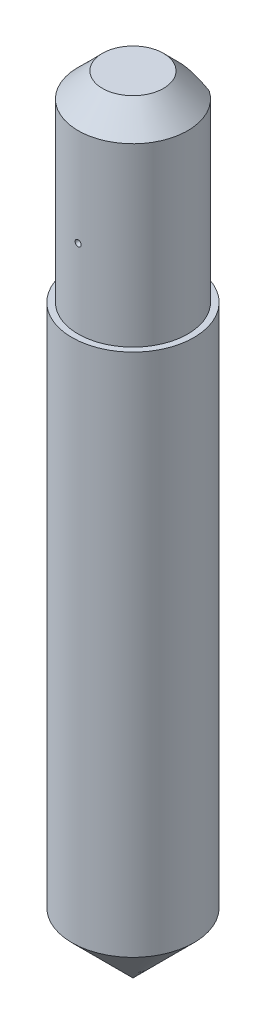
ISO-10303-21;
HEADER;
FILE_DESCRIPTION(('STEP AP214'),'2;1');
FILE_NAME('part.step','',(''),(''),'','','');
FILE_SCHEMA(('AUTOMOTIVE_DESIGN { 1 0 10303 214 1 1 1 1 }'));
ENDSEC;
DATA;
#1=APPLICATION_CONTEXT('core data for automotive mechanical design processes');
#2=APPLICATION_PROTOCOL_DEFINITION('international standard','automotive_design',2000,#1);
#3=PRODUCT_CONTEXT('',#1,'mechanical');
#4=PRODUCT('Part','Part','',(#3));
#5=PRODUCT_RELATED_PRODUCT_CATEGORY('part','',(#4));
#6=PRODUCT_DEFINITION_FORMATION('','',#4);
#7=PRODUCT_DEFINITION_CONTEXT('part definition',#1,'design');
#8=PRODUCT_DEFINITION('design','',#6,#7);
#9=PRODUCT_DEFINITION_SHAPE('','',#8);
#10=(LENGTH_UNIT() NAMED_UNIT(*) SI_UNIT(.MILLI.,.METRE.));
#11=(NAMED_UNIT(*) PLANE_ANGLE_UNIT() SI_UNIT($,.RADIAN.));
#12=(NAMED_UNIT(*) SI_UNIT($,.STERADIAN.) SOLID_ANGLE_UNIT());
#13=UNCERTAINTY_MEASURE_WITH_UNIT(LENGTH_MEASURE(1.E-05),#10,'distance_accuracy_value','');
#14=(GEOMETRIC_REPRESENTATION_CONTEXT(3) GLOBAL_UNCERTAINTY_ASSIGNED_CONTEXT((#13)) GLOBAL_UNIT_ASSIGNED_CONTEXT((#10,
#11,#12)) REPRESENTATION_CONTEXT('',''));
#15=CARTESIAN_POINT('',(0.,0.,0.));
#16=DIRECTION('',(0.,0.,1.));
#17=DIRECTION('',(1.,0.,0.));
#18=AXIS2_PLACEMENT_3D('',#15,#16,#17);
#19=CARTESIAN_POINT('',(0.,48.,0.));
#20=DIRECTION('',(0.,-1.,0.));
#21=DIRECTION('',(0.,0.,-1.));
#22=AXIS2_PLACEMENT_3D('',#19,#20,#21);
#23=CYLINDRICAL_SURFACE('',#22,5.);
#24=CARTESIAN_POINT('',(0.,5.00000000000002,0.));
#25=DIRECTION('',(0.,1.,0.));
#26=DIRECTION('',(0.,0.,1.));
#27=AXIS2_PLACEMENT_3D('',#24,#25,#26);
#28=CIRCLE('',#27,5.);
#29=CARTESIAN_POINT('',(0.,5.00000000000002,5.));
#30=VERTEX_POINT('',#29);
#31=EDGE_CURVE('E113',#30,#30,#28,.T.);
#32=ORIENTED_EDGE('',*,*,#31,.T.);
#33=EDGE_LOOP('',(#32));
#34=FACE_BOUND('',#33,.T.);
#35=CARTESIAN_POINT('',(0.,48.,0.));
#36=DIRECTION('',(0.,1.,0.));
#37=DIRECTION('',(0.,0.,1.));
#38=AXIS2_PLACEMENT_3D('',#35,#36,#37);
#39=CIRCLE('',#38,5.);
#40=CARTESIAN_POINT('',(0.,48.,5.));
#41=VERTEX_POINT('',#40);
#42=EDGE_CURVE('E109',#41,#41,#39,.T.);
#43=ORIENTED_EDGE('',*,*,#42,.F.);
#44=EDGE_LOOP('',(#43));
#45=FACE_BOUND('',#44,.T.);
#46=ADVANCED_FACE('F45',(#34,#45),#23,.T.);
#47=CARTESIAN_POINT('',(0.,48.,0.));
#48=DIRECTION('',(0.,1.,0.));
#49=DIRECTION('',(0.,0.,1.));
#50=AXIS2_PLACEMENT_3D('',#47,#48,#49);
#51=PLANE('',#50);
#52=CARTESIAN_POINT('',(0.,48.,0.));
#53=DIRECTION('',(0.,1.,0.));
#54=DIRECTION('',(0.,0.,1.));
#55=AXIS2_PLACEMENT_3D('',#52,#53,#54);
#56=CIRCLE('',#55,4.5);
#57=CARTESIAN_POINT('',(-2.56124969497314,48.,-3.7));
#58=VERTEX_POINT('',#57);
#59=CARTESIAN_POINT('',(2.56124969497314,48.,-3.7));
#60=VERTEX_POINT('',#59);
#61=EDGE_CURVE('E90',#58,#60,#56,.T.);
#62=ORIENTED_EDGE('',*,*,#61,.F.);
#63=DIRECTION('',(-1.,0.,0.));
#64=VECTOR('',#63,1.);
#65=CARTESIAN_POINT('',(-2.56124969497314,48.,-3.7));
#66=LINE('',#65,#64);
#67=EDGE_CURVE('E95',#60,#58,#66,.T.);
#68=ORIENTED_EDGE('',*,*,#67,.F.);
#69=EDGE_LOOP('',(#62,#68));
#70=FACE_BOUND('',#69,.T.);
#71=ORIENTED_EDGE('',*,*,#42,.T.);
#72=EDGE_LOOP('',(#71));
#73=FACE_BOUND('',#72,.T.);
#74=ADVANCED_FACE('F99',(#70,#73),#51,.T.);
#75=CARTESIAN_POINT('',(0.,5.00000000000002,0.));
#76=DIRECTION('',(0.,1.,0.));
#77=DIRECTION('',(0.,0.,1.));
#78=AXIS2_PLACEMENT_3D('',#75,#76,#77);
#79=CONICAL_SURFACE('',#78,5.00000000000003,0.78539816339745);
#80=CARTESIAN_POINT('',(0.,0.,0.));
#81=VERTEX_POINT('',#80);
#82=VERTEX_LOOP('',#81);
#83=FACE_BOUND('',#82,.T.);
#84=ORIENTED_EDGE('',*,*,#31,.F.);
#85=EDGE_LOOP('',(#84));
#86=FACE_BOUND('',#85,.T.);
#87=ADVANCED_FACE('F132',(#83,#86),#79,.T.);
#88=CARTESIAN_POINT('',(0.,64.45,0.));
#89=DIRECTION('',(0.,-1.,0.));
#90=DIRECTION('',(0.,0.,-1.));
#91=AXIS2_PLACEMENT_3D('',#88,#89,#90);
#92=CYLINDRICAL_SURFACE('',#91,4.5);
#93=CARTESIAN_POINT('',(-0.249903530770433,54.45,4.49305555555555));
#94=CARTESIAN_POINT('',(-0.24990291784127,54.4640399386103,4.49305564844273));
#95=CARTESIAN_POINT('',(-0.248718258594823,54.4780897708447,4.49312196620518));
#96=CARTESIAN_POINT('',(-0.244008814696952,54.5058020570536,4.4933801359805));
#97=CARTESIAN_POINT('',(-0.240481290017374,54.5194640378969,4.49357213497631));
#98=CARTESIAN_POINT('',(-0.231186141050694,54.5459955292694,4.49405991326546));
#99=CARTESIAN_POINT('',(-0.225419583673975,54.5588654138579,4.49435564312405));
#100=CARTESIAN_POINT('',(-0.211810690354123,54.5834499954709,4.49501751008353));
#101=CARTESIAN_POINT('',(-0.203968851060851,54.5951649679661,4.49538363033309));
#102=CARTESIAN_POINT('',(-0.186427727560494,54.6171149553588,4.49614518913201));
#103=CARTESIAN_POINT('',(-0.176727898073159,54.6273495342413,4.49654063626725));
#104=CARTESIAN_POINT('',(-0.155746230395671,54.6460446482927,4.49731620905089));
#105=CARTESIAN_POINT('',(-0.144464332890897,54.6545051169174,4.49769633412414));
#106=CARTESIAN_POINT('',(-0.12064001918251,54.6694104773633,4.4983983564943));
#107=CARTESIAN_POINT('',(-0.108097775969411,54.6758556452996,4.49872026176531));
#108=CARTESIAN_POINT('',(-0.0821073634325151,54.6865489009583,4.49926962514753));
#109=CARTESIAN_POINT('',(-0.0686591997162049,54.6907970022787,4.49949708384328));
#110=CARTESIAN_POINT('',(-0.041249269639048,54.6969731055139,4.49983178716786));
#111=CARTESIAN_POINT('',(-0.0272878897361652,54.6989028177592,4.49993912041209));
#112=CARTESIAN_POINT('',(0.000761081279061244,54.7003930133089,4.50002178663825));
#113=CARTESIAN_POINT('',(0.01484867165789,54.6999535103738,4.49999712038684));
#114=CARTESIAN_POINT('',(0.0427414433177844,54.6967187606186,4.49981862098568));
#115=CARTESIAN_POINT('',(0.0565467859943266,54.6939249009858,4.49966486389647));
#116=CARTESIAN_POINT('',(0.0834919998670323,54.686062548152,4.4992455778447));
#117=CARTESIAN_POINT('',(0.096631869610343,54.6809940499853,4.49898004863814));
#118=CARTESIAN_POINT('',(0.121877535065867,54.6687243083824,4.49836698480398));
#119=CARTESIAN_POINT('',(0.133983031025344,54.661522449399,4.49801942651408));
#120=CARTESIAN_POINT('',(0.156813253968043,54.645190519042,4.49728143119693));
#121=CARTESIAN_POINT('',(0.167537975176558,54.6360604396045,4.49689099399036));
#122=CARTESIAN_POINT('',(0.187311676963675,54.6161223963917,4.49611082547028));
#123=CARTESIAN_POINT('',(0.19635930401668,54.6053130901893,4.49572109497614));
#124=CARTESIAN_POINT('',(0.21251249369392,54.5823281882609,4.49498654420547));
#125=CARTESIAN_POINT('',(0.219618051490093,54.5701525891383,4.49464172404057));
#126=CARTESIAN_POINT('',(0.231688772923491,54.5447751892896,4.49403571762956));
#127=CARTESIAN_POINT('',(0.236653099236861,54.5315729894912,4.49377456411135));
#128=CARTESIAN_POINT('',(0.244296974217683,54.5045212778801,4.49336552754886));
#129=CARTESIAN_POINT('',(0.246976525896264,54.4906717669205,4.4932176443553));
#130=CARTESIAN_POINT('',(0.249974789874456,54.462721705743,4.49305184802764));
#131=CARTESIAN_POINT('',(0.25029400037601,54.448621209131,4.49303390746631));
#132=CARTESIAN_POINT('',(0.248563874365259,54.4205667493636,4.49312994709994));
#133=CARTESIAN_POINT('',(0.24651453970705,54.4066127860934,4.49324392719163));
#134=CARTESIAN_POINT('',(0.240105733074007,54.3792496255379,4.49359092775875));
#135=CARTESIAN_POINT('',(0.235746607227576,54.3658403469541,4.49382393039815));
#136=CARTESIAN_POINT('',(0.224841561447194,54.3399446807631,4.49438270603006));
#137=CARTESIAN_POINT('',(0.218295637700879,54.3274582947648,4.49470847918431));
#138=CARTESIAN_POINT('',(0.20320001551845,54.3037594662351,4.49541618147608));
#139=CARTESIAN_POINT('',(0.194649826327386,54.2925473367121,4.49579812435851));
#140=CARTESIAN_POINT('',(0.1757882103376,54.2717184040547,4.49657506969631));
#141=CARTESIAN_POINT('',(0.165476780939624,54.2621016032747,4.49697007217096));
#142=CARTESIAN_POINT('',(0.143383551784463,54.244735337121,4.49772866068459));
#143=CARTESIAN_POINT('',(0.131601635182849,54.2369860202806,4.49809224422313));
#144=CARTESIAN_POINT('',(0.106902051226345,54.2235757007095,4.4987469780615));
#145=CARTESIAN_POINT('',(0.0939843887538766,54.217914689002,4.49903812867269));
#146=CARTESIAN_POINT('',(0.0673879522613935,54.2088444904046,4.49951503101844));
#147=CARTESIAN_POINT('',(0.0537096305326379,54.205433980556,4.49970084466633));
#148=CARTESIAN_POINT('',(0.0259735489646082,54.20095638979,4.49994640347143));
#149=CARTESIAN_POINT('',(0.0119157902907211,54.1998893016758,4.50000614901581));
#150=CARTESIAN_POINT('',(-0.0161688322552493,54.2001287869094,4.49999284608048));
#151=CARTESIAN_POINT('',(-0.0301957113959328,54.2014335794041,4.49991989723022));
#152=CARTESIAN_POINT('',(-0.0578309534682183,54.2063762937505,4.4996496094896));
#153=CARTESIAN_POINT('',(-0.0714393158863756,54.2100142184645,4.49945227044663));
#154=CARTESIAN_POINT('',(-0.0978516439224202,54.2195200172041,4.49895539818731));
#155=CARTESIAN_POINT('',(-0.110655601577224,54.2253879133009,4.49865586395948));
#156=CARTESIAN_POINT('',(-0.135096009725653,54.2391871403693,4.49798829626126));
#157=CARTESIAN_POINT('',(-0.146732499745934,54.2471184014495,4.49762026511116));
#158=CARTESIAN_POINT('',(-0.168516601799044,54.2648255440166,4.49685681831727));
#159=CARTESIAN_POINT('',(-0.178663256432336,54.2746026025087,4.4964613853026));
#160=CARTESIAN_POINT('',(-0.197174411056968,54.2957242084145,4.49568774868332));
#161=CARTESIAN_POINT('',(-0.205538474272178,54.3070691388732,4.49530954931916));
#162=CARTESIAN_POINT('',(-0.220252742993022,54.3310143125615,4.49461268837282));
#163=CARTESIAN_POINT('',(-0.22660080021459,54.343615876219,4.4942940904503));
#164=CARTESIAN_POINT('',(-0.237085843482598,54.3696976733571,4.49375323349271));
#165=CARTESIAN_POINT('',(-0.241225409692588,54.3831768607579,4.49353086209458));
#166=CARTESIAN_POINT('',(-0.246098451302465,54.4056155164446,4.49326594941829));
#167=CARTESIAN_POINT('',(-0.247523546605391,54.4144304284589,4.4931874005674));
#168=CARTESIAN_POINT('',(-0.249426281016253,54.4321622288892,4.49308217412876));
#169=CARTESIAN_POINT('',(-0.249903920221507,54.4410791172948,4.49305549653566));
#170=CARTESIAN_POINT('',(-0.249903530770433,54.45,4.49305555555555));
#171=B_SPLINE_CURVE_WITH_KNOTS('',3,(#93,#94,#95,#96,#97,#98,#99,#100,#101,#102,#103,#104,#105,
#106,#107,#108,#109,#110,#111,#112,#113,#114,#115,#116,#117,#118,#119,#120,#121,#122,#123,#124,
#125,#126,#127,#128,#129,#130,#131,#132,#133,#134,#135,#136,#137,#138,#139,#140,#141,#142,#143,
#144,#145,#146,#147,#148,#149,#150,#151,#152,#153,#154,#155,#156,#157,#158,#159,#160,#161,#162,
#163,#164,#165,#166,#167,#168,#169,#170),.UNSPECIFIED.,.T.,.F.,(4,2,2,2,2,2,2,2,2,2,2,2,2,2,2,2,
2,2,2,2,2,2,2,2,2,2,2,2,2,2,2,2,2,2,2,2,2,2,4),(0.,0.0420872809245657,0.0842238706474989,
0.126340406664677,0.168446872586925,0.210565714839087,0.25268613662602,0.294800784991731,
0.336915172699174,0.378998472508264,0.421081527894497,0.463139805258639,0.505198174439967,
0.547268690733216,0.589339382969015,0.631443882584177,0.673548486871863,0.715669541177673,
0.757790539971627,0.799902647948115,0.842014722959284,0.884120489147014,0.926226328740386,
0.968342488959379,1.01045871133431,1.05257828238356,1.09469767237519,1.13679228035178,
1.17888675905544,1.22094964547662,1.26301258349934,1.30507593785215,1.3471378675957,
1.38922671001841,1.43132585335489,1.47346970875461,1.51556421938126,1.54230619778281,
1.56904817343759),.UNSPECIFIED.);
#172=CARTESIAN_POINT('',(-0.249903530770433,54.45,4.49305555555555));
#173=VERTEX_POINT('',#172);
#174=EDGE_CURVE('E51',#173,#173,#171,.T.);
#175=ORIENTED_EDGE('',*,*,#174,.T.);
#176=EDGE_LOOP('',(#175));
#177=FACE_BOUND('',#176,.T.);
#178=DIRECTION('',(0.,-1.,0.));
#179=VECTOR('',#178,1.);
#180=CARTESIAN_POINT('',(2.56124969497314,64.45,-3.7));
#181=LINE('',#180,#179);
#182=CARTESIAN_POINT('',(2.56124969497314,62.45,-3.7));
#183=VERTEX_POINT('',#182);
#184=EDGE_CURVE('E94',#183,#60,#181,.T.);
#185=ORIENTED_EDGE('',*,*,#184,.F.);
#186=CARTESIAN_POINT('',(0.,62.45,0.));
#187=DIRECTION('',(0.,1.,0.));
#188=DIRECTION('',(0.,0.,1.));
#189=AXIS2_PLACEMENT_3D('',#186,#187,#188);
#190=CIRCLE('',#189,4.5);
#191=CARTESIAN_POINT('',(-2.56124969497314,62.45,-3.7));
#192=VERTEX_POINT('',#191);
#193=EDGE_CURVE('E62',#183,#192,#190,.F.);
#194=ORIENTED_EDGE('',*,*,#193,.T.);
#195=DIRECTION('',(0.,-1.,0.));
#196=VECTOR('',#195,1.);
#197=CARTESIAN_POINT('',(-2.56124969497314,64.45,-3.7));
#198=LINE('',#197,#196);
#199=EDGE_CURVE('E86',#192,#58,#198,.T.);
#200=ORIENTED_EDGE('',*,*,#199,.T.);
#201=ORIENTED_EDGE('',*,*,#61,.T.);
#202=EDGE_LOOP('',(#185,#194,#200,#201));
#203=FACE_BOUND('',#202,.T.);
#204=ADVANCED_FACE('F89',(#177,#203),#92,.T.);
#205=CARTESIAN_POINT('',(-2.56124969497314,64.45,-3.7));
#206=DIRECTION('',(0.,0.,1.));
#207=DIRECTION('',(1.,0.,0.));
#208=AXIS2_PLACEMENT_3D('',#205,#206,#207);
#209=PLANE('',#208);
#210=ORIENTED_EDGE('',*,*,#199,.F.);
#211=CARTESIAN_POINT('',(-2.56124969497314,62.45,-3.7));
#212=CARTESIAN_POINT('',(-2.49462050046915,62.4879188783641,-3.7));
#213=CARTESIAN_POINT('',(-2.4275656153365,62.5250884587025,-3.7));
#214=CARTESIAN_POINT('',(-2.29251316455352,62.5977170189364,-3.7));
#215=CARTESIAN_POINT('',(-2.22451534551866,62.6331755270996,-3.7));
#216=CARTESIAN_POINT('',(-2.01849603265249,62.7369022185977,-3.7));
#217=CARTESIAN_POINT('',(-1.87896279185587,62.8022248328908,-3.7));
#218=CARTESIAN_POINT('',(-1.59364426971829,62.9234863869612,-3.7));
#219=CARTESIAN_POINT('',(-1.44780073873172,62.9792899289996,-3.7));
#220=CARTESIAN_POINT('',(-1.15177576222746,63.0773818389434,-3.7));
#221=CARTESIAN_POINT('',(-1.00160160043463,63.1196916041516,-3.7));
#222=CARTESIAN_POINT('',(-0.740986067178194,63.1780175695425,-3.7));
#223=CARTESIAN_POINT('',(-0.631453348154155,63.1980924393957,-3.7));
#224=CARTESIAN_POINT('',(-0.4110462324076,63.2288355433091,-3.7));
#225=CARTESIAN_POINT('',(-0.300171804024703,63.2395035549546,-3.7));
#226=CARTESIAN_POINT('',(-0.0788973269995328,63.2507938592236,-3.7));
#227=CARTESIAN_POINT('',(0.0314981493648662,63.2515047918799,-3.7));
#228=CARTESIAN_POINT('',(0.251908324051609,63.2430702217301,-3.7));
#229=CARTESIAN_POINT('',(0.361923016301653,63.2339245624625,-3.7));
#230=CARTESIAN_POINT('',(0.579985089644124,63.2063709913667,-3.7));
#231=CARTESIAN_POINT('',(0.688040851024732,63.1880283597065,-3.7));
#232=CARTESIAN_POINT('',(0.902384492535849,63.1429920015608,-3.7));
#233=CARTESIAN_POINT('',(1.00867220462822,63.1162974860214,-3.7));
#234=CARTESIAN_POINT('',(1.22049152581302,63.0552376585747,-3.7));
#235=CARTESIAN_POINT('',(1.32599547000925,63.0207773898762,-3.7));
#236=CARTESIAN_POINT('',(1.53467092937361,62.9455341725593,-3.7));
#237=CARTESIAN_POINT('',(1.63784296417779,62.9047526487896,-3.7));
#238=CARTESIAN_POINT('',(1.90558465426749,62.7908259243696,-3.7));
#239=CARTESIAN_POINT('',(2.06831253262588,62.7133599587735,-3.7));
#240=CARTESIAN_POINT('',(2.38851639037265,62.5481607751485,-3.7));
#241=CARTESIAN_POINT('',(2.54598835353232,62.46041992654,-3.7));
#242=CARTESIAN_POINT('',(2.85707294068248,62.2769892188163,-3.7));
#243=CARTESIAN_POINT('',(3.01066695453732,62.1812680477638,-3.7));
#244=CARTESIAN_POINT('',(3.31407215121735,61.9841377260736,-3.7));
#245=CARTESIAN_POINT('',(3.46388435551093,61.8827301357029,-3.7));
#246=CARTESIAN_POINT('',(3.75101229002884,61.6821507882445,-3.7));
#247=CARTESIAN_POINT('',(3.88851652387778,61.583247489298,-3.7));
#248=CARTESIAN_POINT('',(4.16131062842957,61.3824158970857,-3.7));
#249=CARTESIAN_POINT('',(4.29660029646165,61.2804873293307,-3.7));
#250=CARTESIAN_POINT('',(4.56402974037727,61.0752169241018,-3.7));
#251=CARTESIAN_POINT('',(4.69618731091467,60.9718981958968,-3.7));
#252=CARTESIAN_POINT('',(4.95893084399536,60.7633450650205,-3.7));
#253=CARTESIAN_POINT('',(5.08951718467246,60.6581111392257,-3.7));
#254=CARTESIAN_POINT('',(5.21947373364989,60.5521170645079,-3.7));
#255=B_SPLINE_CURVE_WITH_KNOTS('',3,(#211,#212,#213,#214,#215,#216,#217,#218,#219,#220,#221,
#222,#223,#224,#225,#226,#227,#228,#229,#230,#231,#232,#233,#234,#235,#236,#237,#238,#239,#240,
#241,#242,#243,#244,#245,#246,#247,#248,#249,#250,#251,#252,#253,#254),.UNSPECIFIED.,.F.,.F.,(4,
2,2,2,2,2,2,2,2,2,2,2,2,2,2,2,2,2,2,2,2,4),(0.,0.229981138617835,0.460025323614237,
0.921892218161797,1.38986205121942,1.85708608412115,2.19079966304052,2.52452113203079,
2.85526983385073,3.1860237859846,3.51446259208953,3.84293243720336,4.17566051872748,
4.50831371012565,5.04844950277399,5.58898899866541,6.13175935973817,6.6743815147525,
7.18246912124792,7.69060296939564,8.19383642697172,8.69694625081813),.UNSPECIFIED.);
#256=EDGE_CURVE('E11',#192,#183,#255,.T.);
#257=ORIENTED_EDGE('',*,*,#256,.T.);
#258=ORIENTED_EDGE('',*,*,#184,.T.);
#259=ORIENTED_EDGE('',*,*,#67,.T.);
#260=EDGE_LOOP('',(#210,#257,#258,#259));
#261=FACE_BOUND('',#260,.T.);
#262=ADVANCED_FACE('F103',(#261),#209,.F.);
#263=CARTESIAN_POINT('',(0.,64.45,0.));
#264=DIRECTION('',(0.,1.,0.));
#265=DIRECTION('',(0.,0.,1.));
#266=AXIS2_PLACEMENT_3D('',#263,#264,#265);
#267=PLANE('',#266);
#268=CARTESIAN_POINT('',(0.,64.45,0.));
#269=DIRECTION('',(0.,1.,0.));
#270=DIRECTION('',(0.,0.,1.));
#271=AXIS2_PLACEMENT_3D('',#268,#269,#270);
#272=CIRCLE('',#271,2.5);
#273=CARTESIAN_POINT('',(-1.4229164972073,64.45,-2.05555555555556));
#274=VERTEX_POINT('',#273);
#275=EDGE_CURVE('E67',#274,#274,#272,.T.);
#276=ORIENTED_EDGE('',*,*,#275,.T.);
#277=EDGE_LOOP('',(#276));
#278=FACE_BOUND('',#277,.T.);
#279=ADVANCED_FACE('F128',(#278),#267,.T.);
#280=CARTESIAN_POINT('',(0.,64.45,0.));
#281=DIRECTION('',(0.,-1.,0.));
#282=DIRECTION('',(0.,0.,-1.));
#283=AXIS2_PLACEMENT_3D('',#280,#281,#282);
#284=CONICAL_SURFACE('',#283,2.5,0.785398163397444);
#285=ORIENTED_EDGE('',*,*,#256,.F.);
#286=ORIENTED_EDGE('',*,*,#193,.F.);
#287=EDGE_LOOP('',(#285,#286));
#288=FACE_BOUND('',#287,.T.);
#289=ORIENTED_EDGE('',*,*,#275,.F.);
#290=EDGE_LOOP('',(#289));
#291=FACE_BOUND('',#290,.T.);
#292=ADVANCED_FACE('F48',(#288,#291),#284,.T.);
#293=CARTESIAN_POINT('',(0.,54.45,4.5));
#294=DIRECTION('',(0.,-1.,0.));
#295=DIRECTION('',(0.,0.,1.));
#296=AXIS2_PLACEMENT_3D('',#293,#294,#295);
#297=SPHERICAL_SURFACE('',#296,0.25);
#298=ORIENTED_EDGE('',*,*,#174,.F.);
#299=EDGE_LOOP('',(#298));
#300=FACE_BOUND('',#299,.T.);
#301=ADVANCED_FACE('F173',(#300),#297,.F.);
#302=CLOSED_SHELL('',(#46,#74,#87,#204,#262,#279,#292,#301));
#303=MANIFOLD_SOLID_BREP('B2',#302);
#304=ADVANCED_BREP_SHAPE_REPRESENTATION('',(#18,#303),#14);
#305=SHAPE_DEFINITION_REPRESENTATION(#9,#304);
ENDSEC;
END-ISO-10303-21;
